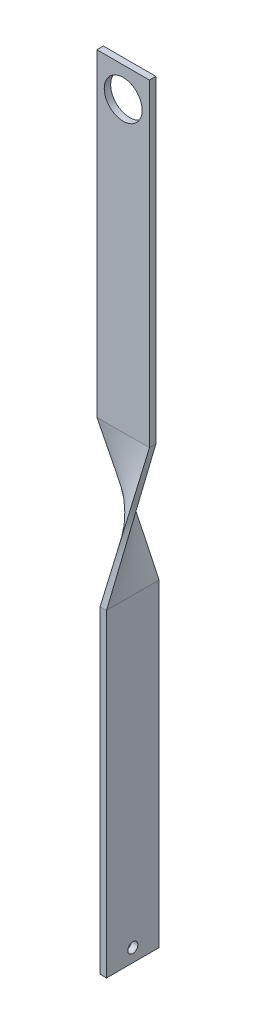
ISO-10303-21;
HEADER;
FILE_DESCRIPTION(('STEP AP214'),'2;1');
FILE_NAME('part.step','',(''),(''),'','','');
FILE_SCHEMA(('AUTOMOTIVE_DESIGN { 1 0 10303 214 1 1 1 1 }'));
ENDSEC;
DATA;
#1=APPLICATION_CONTEXT('core data for automotive mechanical design processes');
#2=APPLICATION_PROTOCOL_DEFINITION('international standard','automotive_design',2000,#1);
#3=PRODUCT_CONTEXT('',#1,'mechanical');
#4=PRODUCT('Part','Part','',(#3));
#5=PRODUCT_RELATED_PRODUCT_CATEGORY('part','',(#4));
#6=PRODUCT_DEFINITION_FORMATION('','',#4);
#7=PRODUCT_DEFINITION_CONTEXT('part definition',#1,'design');
#8=PRODUCT_DEFINITION('design','',#6,#7);
#9=PRODUCT_DEFINITION_SHAPE('','',#8);
#10=(LENGTH_UNIT() NAMED_UNIT(*) SI_UNIT(.MILLI.,.METRE.));
#11=(NAMED_UNIT(*) PLANE_ANGLE_UNIT() SI_UNIT($,.RADIAN.));
#12=(NAMED_UNIT(*) SI_UNIT($,.STERADIAN.) SOLID_ANGLE_UNIT());
#13=UNCERTAINTY_MEASURE_WITH_UNIT(LENGTH_MEASURE(1.E-05),#10,'distance_accuracy_value','');
#14=(GEOMETRIC_REPRESENTATION_CONTEXT(3) GLOBAL_UNCERTAINTY_ASSIGNED_CONTEXT((#13)) GLOBAL_UNIT_ASSIGNED_CONTEXT((#10,
#11,#12)) REPRESENTATION_CONTEXT('',''));
#15=CARTESIAN_POINT('',(0.,0.,0.));
#16=DIRECTION('',(0.,0.,1.));
#17=DIRECTION('',(1.,0.,0.));
#18=AXIS2_PLACEMENT_3D('',#15,#16,#17);
#19=CARTESIAN_POINT('',(0.,0.,1.6129));
#20=DIRECTION('',(1.,0.,0.));
#21=DIRECTION('',(0.,0.,-1.));
#22=AXIS2_PLACEMENT_3D('',#19,#20,#21);
#23=PLANE('',#22);
#24=DIRECTION('',(0.,-1.,0.));
#25=VECTOR('',#24,1.);
#26=CARTESIAN_POINT('',(0.,0.,0.));
#27=LINE('',#26,#25);
#28=CARTESIAN_POINT('',(0.,0.,0.));
#29=VERTEX_POINT('',#28);
#30=CARTESIAN_POINT('',(0.,-79.9999999999999,0.));
#31=VERTEX_POINT('',#30);
#32=EDGE_CURVE('E218',#29,#31,#27,.T.);
#33=ORIENTED_EDGE('',*,*,#32,.T.);
#34=DIRECTION('',(0.,0.,-1.));
#35=VECTOR('',#34,1.);
#36=CARTESIAN_POINT('',(0.,-80.,1.6129));
#37=LINE('',#36,#35);
#38=CARTESIAN_POINT('',(0.,-79.9999999999999,1.61290000000001));
#39=VERTEX_POINT('',#38);
#40=EDGE_CURVE('E12',#39,#31,#37,.T.);
#41=ORIENTED_EDGE('',*,*,#40,.F.);
#42=DIRECTION('',(0.,-1.,0.));
#43=VECTOR('',#42,1.);
#44=CARTESIAN_POINT('',(0.,0.,1.6129));
#45=LINE('',#44,#43);
#46=CARTESIAN_POINT('',(0.,0.,1.6129));
#47=VERTEX_POINT('',#46);
#48=EDGE_CURVE('E92',#47,#39,#45,.T.);
#49=ORIENTED_EDGE('',*,*,#48,.F.);
#50=DIRECTION('',(0.,0.,-1.));
#51=VECTOR('',#50,1.);
#52=CARTESIAN_POINT('',(0.,0.,1.6129));
#53=LINE('',#52,#51);
#54=EDGE_CURVE('E284',#47,#29,#53,.T.);
#55=ORIENTED_EDGE('',*,*,#54,.T.);
#56=EDGE_LOOP('',(#33,#41,#49,#55));
#57=FACE_BOUND('',#56,.T.);
#58=ADVANCED_FACE('F47',(#57),#23,.F.);
#59=CARTESIAN_POINT('',(13.208,0.,1.6129));
#60=DIRECTION('',(-1.,0.,0.));
#61=DIRECTION('',(0.,-1.,0.));
#62=AXIS2_PLACEMENT_3D('',#59,#60,#61);
#63=PLANE('',#62);
#64=DIRECTION('',(0.,1.,0.));
#65=VECTOR('',#64,1.);
#66=CARTESIAN_POINT('',(13.208,0.,0.));
#67=LINE('',#66,#65);
#68=CARTESIAN_POINT('',(13.208,-80.,0.));
#69=VERTEX_POINT('',#68);
#70=CARTESIAN_POINT('',(13.208,0.,0.));
#71=VERTEX_POINT('',#70);
#72=EDGE_CURVE('E288',#69,#71,#67,.T.);
#73=ORIENTED_EDGE('',*,*,#72,.T.);
#74=DIRECTION('',(0.,0.,-1.));
#75=VECTOR('',#74,1.);
#76=CARTESIAN_POINT('',(13.208,0.,1.6129));
#77=LINE('',#76,#75);
#78=CARTESIAN_POINT('',(13.208,0.,1.6129));
#79=VERTEX_POINT('',#78);
#80=EDGE_CURVE('E106',#79,#71,#77,.T.);
#81=ORIENTED_EDGE('',*,*,#80,.F.);
#82=DIRECTION('',(0.,1.,0.));
#83=VECTOR('',#82,1.);
#84=CARTESIAN_POINT('',(13.208,0.,1.6129));
#85=LINE('',#84,#83);
#86=CARTESIAN_POINT('',(13.208,-79.9999999999996,1.61289999999997));
#87=VERTEX_POINT('',#86);
#88=EDGE_CURVE('E89',#87,#79,#85,.T.);
#89=ORIENTED_EDGE('',*,*,#88,.F.);
#90=DIRECTION('',(0.,0.,1.));
#91=VECTOR('',#90,1.);
#92=CARTESIAN_POINT('',(13.208,-80.,1.6129));
#93=LINE('',#92,#91);
#94=EDGE_CURVE('E57',#87,#69,#93,.F.);
#95=ORIENTED_EDGE('',*,*,#94,.T.);
#96=EDGE_LOOP('',(#73,#81,#89,#95));
#97=FACE_BOUND('',#96,.T.);
#98=ADVANCED_FACE('F103',(#97),#63,.F.);
#99=CARTESIAN_POINT('',(0.,0.,1.6129));
#100=DIRECTION('',(0.,-1.,0.));
#101=DIRECTION('',(0.,0.,-1.));
#102=AXIS2_PLACEMENT_3D('',#99,#100,#101);
#103=PLANE('',#102);
#104=DIRECTION('',(-1.,0.,0.));
#105=VECTOR('',#104,1.);
#106=CARTESIAN_POINT('',(0.,0.,0.));
#107=LINE('',#106,#105);
#108=EDGE_CURVE('E285',#71,#29,#107,.T.);
#109=ORIENTED_EDGE('',*,*,#108,.T.);
#110=ORIENTED_EDGE('',*,*,#54,.F.);
#111=DIRECTION('',(-1.,0.,0.));
#112=VECTOR('',#111,1.);
#113=CARTESIAN_POINT('',(0.,0.,1.6129));
#114=LINE('',#113,#112);
#115=EDGE_CURVE('E66',#79,#47,#114,.T.);
#116=ORIENTED_EDGE('',*,*,#115,.F.);
#117=ORIENTED_EDGE('',*,*,#80,.T.);
#118=EDGE_LOOP('',(#109,#110,#116,#117));
#119=FACE_BOUND('',#118,.T.);
#120=ADVANCED_FACE('F373',(#119),#103,.F.);
#121=CARTESIAN_POINT('',(0.,0.,1.6129));
#122=DIRECTION('',(0.,0.,1.));
#123=DIRECTION('',(1.,0.,0.));
#124=AXIS2_PLACEMENT_3D('',#121,#122,#123);
#125=PLANE('',#124);
#126=CARTESIAN_POINT('',(6.604,-7.5,1.6129));
#127=DIRECTION('',(0.,0.,1.));
#128=DIRECTION('',(1.,0.,0.));
#129=AXIS2_PLACEMENT_3D('',#126,#127,#128);
#130=CIRCLE('',#129,4.7625);
#131=CARTESIAN_POINT('',(11.3665,-7.5,1.6129));
#132=VERTEX_POINT('',#131);
#133=EDGE_CURVE('E450',#132,#132,#130,.T.);
#134=ORIENTED_EDGE('',*,*,#133,.F.);
#135=EDGE_LOOP('',(#134));
#136=FACE_BOUND('',#135,.T.);
#137=ORIENTED_EDGE('',*,*,#48,.T.);
#138=DIRECTION('',(1.,0.,0.));
#139=VECTOR('',#138,1.);
#140=CARTESIAN_POINT('',(0.,-80.,1.6129));
#141=LINE('',#140,#139);
#142=EDGE_CURVE('E86',#39,#87,#141,.T.);
#143=ORIENTED_EDGE('',*,*,#142,.T.);
#144=ORIENTED_EDGE('',*,*,#88,.T.);
#145=ORIENTED_EDGE('',*,*,#115,.T.);
#146=EDGE_LOOP('',(#137,#143,#144,#145));
#147=FACE_BOUND('',#146,.T.);
#148=ADVANCED_FACE('F88',(#136,#147),#125,.T.);
#149=CARTESIAN_POINT('',(0.,0.,0.));
#150=DIRECTION('',(0.,0.,1.));
#151=DIRECTION('',(1.,0.,0.));
#152=AXIS2_PLACEMENT_3D('',#149,#150,#151);
#153=PLANE('',#152);
#154=CARTESIAN_POINT('',(6.604,-7.5,0.));
#155=DIRECTION('',(0.,0.,-1.));
#156=DIRECTION('',(-1.,0.,0.));
#157=AXIS2_PLACEMENT_3D('',#154,#155,#156);
#158=CIRCLE('',#157,4.7625);
#159=CARTESIAN_POINT('',(1.8415,-7.5,0.));
#160=VERTEX_POINT('',#159);
#161=EDGE_CURVE('E453',#160,#160,#158,.T.);
#162=ORIENTED_EDGE('',*,*,#161,.F.);
#163=EDGE_LOOP('',(#162));
#164=FACE_BOUND('',#163,.T.);
#165=ORIENTED_EDGE('',*,*,#32,.F.);
#166=ORIENTED_EDGE('',*,*,#108,.F.);
#167=ORIENTED_EDGE('',*,*,#72,.F.);
#168=DIRECTION('',(1.,0.,0.));
#169=VECTOR('',#168,1.);
#170=CARTESIAN_POINT('',(0.,-80.,0.));
#171=LINE('',#170,#169);
#172=EDGE_CURVE('E296',#31,#69,#171,.T.);
#173=ORIENTED_EDGE('',*,*,#172,.F.);
#174=EDGE_LOOP('',(#165,#166,#167,#173));
#175=FACE_BOUND('',#174,.T.);
#176=ADVANCED_FACE('F378',(#164,#175),#153,.F.);
#177=CARTESIAN_POINT('',(13.208,-80.,1.6129));
#178=CARTESIAN_POINT('',(6.604,-115.,7.41045));
#179=CARTESIAN_POINT('',(11.0066666666667,-80.,1.6129));
#180=CARTESIAN_POINT('',(6.604,-115.,5.20911666666666));
#181=CARTESIAN_POINT('',(8.80533333333331,-80.,1.6129));
#182=CARTESIAN_POINT('',(6.604,-115.,3.00778333333333));
#183=CARTESIAN_POINT('',(4.40266666666664,-80.,1.6129));
#184=CARTESIAN_POINT('',(6.604,-115.,-1.39488333333333));
#185=CARTESIAN_POINT('',(2.20133333333332,-80.,1.6129));
#186=CARTESIAN_POINT('',(6.604,-115.,-3.59621666666667));
#187=CARTESIAN_POINT('',(0.,-80.,1.6129));
#188=CARTESIAN_POINT('',(6.604,-115.,-5.79755));
#189=B_SPLINE_SURFACE_WITH_KNOTS('',3,1,((#177,#178),(#179,#180),(#181,#182),(#183,#184),(#185,
#186),(#187,#188)),.UNSPECIFIED.,.F.,.F.,.F.,(4,2,4),(2,2),(0.,0.5,1.),(0.,1.),.UNSPECIFIED.);
#190=DIRECTION('',(0.181526722270291,-0.962058643164778,-0.203693927778298));
#191=VECTOR('',#190,1.);
#192=CARTESIAN_POINT('',(3.302,-97.5,-2.092325));
#193=LINE('',#192,#191);
#194=CARTESIAN_POINT('',(6.604,-115.,-5.79755));
#195=VERTEX_POINT('',#194);
#196=EDGE_CURVE('E127',#39,#195,#193,.T.);
#197=DIRECTION('',(0.,0.,1.));
#198=VECTOR('',#197,1.);
#199=CARTESIAN_POINT('',(6.604,-115.,7.41045));
#200=LINE('',#199,#198);
#201=CARTESIAN_POINT('',(6.604,-115.,7.41045));
#202=VERTEX_POINT('',#201);
#203=EDGE_CURVE('E123',#195,#202,#200,.T.);
#204=DIRECTION('',(0.183005503323815,0.969895914042023,-0.160657715898695));
#205=VECTOR('',#204,1.);
#206=CARTESIAN_POINT('',(9.90600000000001,-97.5,4.511675));
#207=LINE('',#206,#205);
#208=EDGE_CURVE('E115',#202,#87,#207,.T.);
#209=ORIENTED_EDGE('',*,*,#142,.F.);
#210=ORIENTED_EDGE('',*,*,#196,.T.);
#211=ORIENTED_EDGE('',*,*,#203,.T.);
#212=ORIENTED_EDGE('',*,*,#208,.T.);
#213=EDGE_LOOP('',(#209,#210,#211,#212));
#214=FACE_BOUND('',#213,.T.);
#215=ADVANCED_FACE('F121',(#214),#189,.T.);
#216=CARTESIAN_POINT('',(0.,-80.,1.6129));
#217=CARTESIAN_POINT('',(6.604,-115.,-5.79755));
#218=CARTESIAN_POINT('',(0.,-80.,1.34408333333333));
#219=CARTESIAN_POINT('',(6.87281666666667,-115.,-5.79755));
#220=CARTESIAN_POINT('',(0.,-80.,1.07526666666667));
#221=CARTESIAN_POINT('',(7.14163333333333,-115.,-5.79755));
#222=CARTESIAN_POINT('',(0.,-80.,0.537633333333334));
#223=CARTESIAN_POINT('',(7.67926666666667,-115.,-5.79755));
#224=CARTESIAN_POINT('',(0.,-80.,0.268816666666667));
#225=CARTESIAN_POINT('',(7.94808333333333,-115.,-5.79755));
#226=CARTESIAN_POINT('',(0.,-80.,0.));
#227=CARTESIAN_POINT('',(8.2169,-115.,-5.79755));
#228=B_SPLINE_SURFACE_WITH_KNOTS('',3,1,((#216,#217),(#218,#219),(#220,#221),(#222,#223),(#224,
#225),(#226,#227)),.UNSPECIFIED.,.F.,.F.,.F.,(4,2,4),(2,2),(0.,0.5,1.),(0.,1.),.UNSPECIFIED.);
#229=DIRECTION('',(0.2256394904228,-0.961114552300502,-0.159203133505422));
#230=VECTOR('',#229,1.);
#231=CARTESIAN_POINT('',(4.10845,-97.5,-2.898775));
#232=LINE('',#231,#230);
#233=CARTESIAN_POINT('',(8.2169,-115.,-5.79755));
#234=VERTEX_POINT('',#233);
#235=EDGE_CURVE('E132',#31,#234,#232,.T.);
#236=DIRECTION('',(-1.,0.,0.));
#237=VECTOR('',#236,1.);
#238=CARTESIAN_POINT('',(8.2169,-115.,-5.79755));
#239=LINE('',#238,#237);
#240=EDGE_CURVE('E149',#234,#195,#239,.T.);
#241=ORIENTED_EDGE('',*,*,#40,.T.);
#242=ORIENTED_EDGE('',*,*,#235,.T.);
#243=ORIENTED_EDGE('',*,*,#240,.T.);
#244=ORIENTED_EDGE('',*,*,#196,.F.);
#245=EDGE_LOOP('',(#241,#242,#243,#244));
#246=FACE_BOUND('',#245,.T.);
#247=ADVANCED_FACE('F156',(#246),#228,.T.);
#248=CARTESIAN_POINT('',(13.208,-80.,0.));
#249=CARTESIAN_POINT('',(8.2169,-115.,7.41045));
#250=CARTESIAN_POINT('',(13.208,-80.,0.268816666666667));
#251=CARTESIAN_POINT('',(7.94808333333333,-115.,7.41045));
#252=CARTESIAN_POINT('',(13.208,-80.,0.537633333333334));
#253=CARTESIAN_POINT('',(7.67926666666667,-115.,7.41045));
#254=CARTESIAN_POINT('',(13.208,-80.,1.07526666666667));
#255=CARTESIAN_POINT('',(7.14163333333333,-115.,7.41045));
#256=CARTESIAN_POINT('',(13.208,-80.,1.34408333333333));
#257=CARTESIAN_POINT('',(6.87281666666667,-115.,7.41045));
#258=CARTESIAN_POINT('',(13.208,-80.,1.6129));
#259=CARTESIAN_POINT('',(6.604,-115.,7.41045));
#260=B_SPLINE_SURFACE_WITH_KNOTS('',3,1,((#248,#249),(#250,#251),(#252,#253),(#254,#255),(#256,
#257),(#258,#259)),.UNSPECIFIED.,.F.,.F.,.F.,(4,2,4),(2,2),(0.,0.5,1.),(0.,1.),.UNSPECIFIED.);
#261=DIRECTION('',(-1.,0.,0.));
#262=VECTOR('',#261,1.);
#263=CARTESIAN_POINT('',(8.2169,-115.,7.41045));
#264=LINE('',#263,#262);
#265=CARTESIAN_POINT('',(8.2169,-115.,7.41045));
#266=VERTEX_POINT('',#265);
#267=EDGE_CURVE('E268',#266,#202,#264,.T.);
#268=DIRECTION('',(-0.138171984630874,-0.968928585297948,0.205148480997748));
#269=VECTOR('',#268,1.);
#270=CARTESIAN_POINT('',(10.71245,-97.5,3.705225));
#271=LINE('',#270,#269);
#272=EDGE_CURVE('E118',#69,#266,#271,.T.);
#273=ORIENTED_EDGE('',*,*,#94,.F.);
#274=ORIENTED_EDGE('',*,*,#208,.F.);
#275=ORIENTED_EDGE('',*,*,#267,.F.);
#276=ORIENTED_EDGE('',*,*,#272,.F.);
#277=EDGE_LOOP('',(#273,#274,#275,#276));
#278=FACE_BOUND('',#277,.T.);
#279=ADVANCED_FACE('F112',(#278),#260,.T.);
#280=CARTESIAN_POINT('',(0.,-80.,0.));
#281=CARTESIAN_POINT('',(8.2169,-115.,-5.79755));
#282=CARTESIAN_POINT('',(2.20133333333333,-80.,0.));
#283=CARTESIAN_POINT('',(8.2169,-115.,-3.59621666666666));
#284=CARTESIAN_POINT('',(4.40266666666667,-80.,0.));
#285=CARTESIAN_POINT('',(8.2169,-115.,-1.39488333333333));
#286=CARTESIAN_POINT('',(8.80533333333334,-80.,0.));
#287=CARTESIAN_POINT('',(8.2169,-115.,3.00778333333334));
#288=CARTESIAN_POINT('',(11.0066666666667,-80.,0.));
#289=CARTESIAN_POINT('',(8.2169,-115.,5.20911666666667));
#290=CARTESIAN_POINT('',(13.208,-80.,0.));
#291=CARTESIAN_POINT('',(8.2169,-115.,7.41045));
#292=B_SPLINE_SURFACE_WITH_KNOTS('',3,1,((#280,#281),(#282,#283),(#284,#285),(#286,#287),(#288,
#289),(#290,#291)),.UNSPECIFIED.,.F.,.F.,.F.,(4,2,4),(2,2),(0.,0.5,1.),(0.,1.),.UNSPECIFIED.);
#293=DIRECTION('',(0.,0.,1.));
#294=VECTOR('',#293,1.);
#295=CARTESIAN_POINT('',(8.2169,-115.,7.41045));
#296=LINE('',#295,#294);
#297=EDGE_CURVE('E219',#234,#266,#296,.T.);
#298=ORIENTED_EDGE('',*,*,#172,.T.);
#299=ORIENTED_EDGE('',*,*,#272,.T.);
#300=ORIENTED_EDGE('',*,*,#297,.F.);
#301=ORIENTED_EDGE('',*,*,#235,.F.);
#302=EDGE_LOOP('',(#298,#299,#300,#301));
#303=FACE_BOUND('',#302,.T.);
#304=ADVANCED_FACE('F182',(#303),#292,.T.);
#305=CARTESIAN_POINT('',(8.2169,-195.,-5.79755));
#306=DIRECTION('',(0.,0.,1.));
#307=DIRECTION('',(1.,0.,0.));
#308=AXIS2_PLACEMENT_3D('',#305,#306,#307);
#309=PLANE('',#308);
#310=DIRECTION('',(0.,1.,0.));
#311=VECTOR('',#310,1.);
#312=CARTESIAN_POINT('',(6.604,-195.,-5.79755));
#313=LINE('',#312,#311);
#314=CARTESIAN_POINT('',(6.604,-195.,-5.79755));
#315=VERTEX_POINT('',#314);
#316=EDGE_CURVE('E223',#315,#195,#313,.T.);
#317=ORIENTED_EDGE('',*,*,#316,.T.);
#318=ORIENTED_EDGE('',*,*,#240,.F.);
#319=DIRECTION('',(0.,1.,0.));
#320=VECTOR('',#319,1.);
#321=CARTESIAN_POINT('',(8.2169,-195.,-5.79755));
#322=LINE('',#321,#320);
#323=CARTESIAN_POINT('',(8.2169,-195.,-5.79755));
#324=VERTEX_POINT('',#323);
#325=EDGE_CURVE('E312',#324,#234,#322,.T.);
#326=ORIENTED_EDGE('',*,*,#325,.F.);
#327=DIRECTION('',(-1.,0.,0.));
#328=VECTOR('',#327,1.);
#329=CARTESIAN_POINT('',(8.2169,-195.,-5.79755));
#330=LINE('',#329,#328);
#331=EDGE_CURVE('E135',#324,#315,#330,.T.);
#332=ORIENTED_EDGE('',*,*,#331,.T.);
#333=EDGE_LOOP('',(#317,#318,#326,#332));
#334=FACE_BOUND('',#333,.T.);
#335=ADVANCED_FACE('F259',(#334),#309,.F.);
#336=CARTESIAN_POINT('',(8.2169,-195.,7.41045));
#337=DIRECTION('',(0.,0.,-1.));
#338=DIRECTION('',(-1.,0.,0.));
#339=AXIS2_PLACEMENT_3D('',#336,#337,#338);
#340=PLANE('',#339);
#341=DIRECTION('',(0.,-1.,0.));
#342=VECTOR('',#341,1.);
#343=CARTESIAN_POINT('',(6.604,-195.,7.41045));
#344=LINE('',#343,#342);
#345=CARTESIAN_POINT('',(6.604,-195.,7.41045));
#346=VERTEX_POINT('',#345);
#347=EDGE_CURVE('E227',#202,#346,#344,.T.);
#348=ORIENTED_EDGE('',*,*,#347,.T.);
#349=DIRECTION('',(-1.,0.,0.));
#350=VECTOR('',#349,1.);
#351=CARTESIAN_POINT('',(8.2169,-195.,7.41045));
#352=LINE('',#351,#350);
#353=CARTESIAN_POINT('',(8.2169,-195.,7.41045));
#354=VERTEX_POINT('',#353);
#355=EDGE_CURVE('E128',#354,#346,#352,.T.);
#356=ORIENTED_EDGE('',*,*,#355,.F.);
#357=DIRECTION('',(0.,-1.,0.));
#358=VECTOR('',#357,1.);
#359=CARTESIAN_POINT('',(8.2169,-195.,7.41045));
#360=LINE('',#359,#358);
#361=EDGE_CURVE('E277',#266,#354,#360,.T.);
#362=ORIENTED_EDGE('',*,*,#361,.F.);
#363=ORIENTED_EDGE('',*,*,#267,.T.);
#364=EDGE_LOOP('',(#348,#356,#362,#363));
#365=FACE_BOUND('',#364,.T.);
#366=ADVANCED_FACE('F255',(#365),#340,.F.);
#367=CARTESIAN_POINT('',(8.2169,-195.,7.41045));
#368=DIRECTION('',(0.,1.,0.));
#369=DIRECTION('',(0.,0.,1.));
#370=AXIS2_PLACEMENT_3D('',#367,#368,#369);
#371=PLANE('',#370);
#372=DIRECTION('',(0.,0.,-1.));
#373=VECTOR('',#372,1.);
#374=CARTESIAN_POINT('',(6.604,-195.,7.41045));
#375=LINE('',#374,#373);
#376=EDGE_CURVE('E306',#346,#315,#375,.T.);
#377=ORIENTED_EDGE('',*,*,#376,.T.);
#378=ORIENTED_EDGE('',*,*,#331,.F.);
#379=DIRECTION('',(0.,0.,-1.));
#380=VECTOR('',#379,1.);
#381=CARTESIAN_POINT('',(8.2169,-195.,7.41045));
#382=LINE('',#381,#380);
#383=EDGE_CURVE('E323',#354,#324,#382,.T.);
#384=ORIENTED_EDGE('',*,*,#383,.F.);
#385=ORIENTED_EDGE('',*,*,#355,.T.);
#386=EDGE_LOOP('',(#377,#378,#384,#385));
#387=FACE_BOUND('',#386,.T.);
#388=ADVANCED_FACE('F252',(#387),#371,.F.);
#389=CARTESIAN_POINT('',(8.2169,0.,0.));
#390=DIRECTION('',(-1.,0.,0.));
#391=DIRECTION('',(0.,0.,1.));
#392=AXIS2_PLACEMENT_3D('',#389,#390,#391);
#393=PLANE('',#392);
#394=CARTESIAN_POINT('',(8.2169,-191.698,0.806449999999999));
#395=DIRECTION('',(1.,0.,0.));
#396=DIRECTION('',(0.,0.,-1.));
#397=AXIS2_PLACEMENT_3D('',#394,#395,#396);
#398=CIRCLE('',#397,1.27);
#399=CARTESIAN_POINT('',(8.2169,-191.698,-0.463550000000003));
#400=VERTEX_POINT('',#399);
#401=EDGE_CURVE('E457',#400,#400,#398,.T.);
#402=ORIENTED_EDGE('',*,*,#401,.F.);
#403=EDGE_LOOP('',(#402));
#404=FACE_BOUND('',#403,.T.);
#405=ORIENTED_EDGE('',*,*,#325,.T.);
#406=ORIENTED_EDGE('',*,*,#297,.T.);
#407=ORIENTED_EDGE('',*,*,#361,.T.);
#408=ORIENTED_EDGE('',*,*,#383,.T.);
#409=EDGE_LOOP('',(#405,#406,#407,#408));
#410=FACE_BOUND('',#409,.T.);
#411=ADVANCED_FACE('F248',(#404,#410),#393,.F.);
#412=CARTESIAN_POINT('',(6.604,0.,0.));
#413=DIRECTION('',(-1.,0.,0.));
#414=DIRECTION('',(0.,0.,1.));
#415=AXIS2_PLACEMENT_3D('',#412,#413,#414);
#416=PLANE('',#415);
#417=CARTESIAN_POINT('',(6.604,-191.698,0.806449999999999));
#418=DIRECTION('',(-1.,0.,0.));
#419=DIRECTION('',(0.,0.,1.));
#420=AXIS2_PLACEMENT_3D('',#417,#418,#419);
#421=CIRCLE('',#420,1.27);
#422=CARTESIAN_POINT('',(6.604,-191.698,2.07645));
#423=VERTEX_POINT('',#422);
#424=EDGE_CURVE('E50',#423,#423,#421,.T.);
#425=ORIENTED_EDGE('',*,*,#424,.F.);
#426=EDGE_LOOP('',(#425));
#427=FACE_BOUND('',#426,.T.);
#428=ORIENTED_EDGE('',*,*,#316,.F.);
#429=ORIENTED_EDGE('',*,*,#376,.F.);
#430=ORIENTED_EDGE('',*,*,#347,.F.);
#431=ORIENTED_EDGE('',*,*,#203,.F.);
#432=EDGE_LOOP('',(#428,#429,#430,#431));
#433=FACE_BOUND('',#432,.T.);
#434=ADVANCED_FACE('F237',(#427,#433),#416,.T.);
#435=CARTESIAN_POINT('',(-2.50000000111272E-05,-191.698,0.806449999999999));
#436=DIRECTION('',(1.,0.,0.));
#437=DIRECTION('',(0.,0.,-1.));
#438=AXIS2_PLACEMENT_3D('',#435,#436,#437);
#439=CYLINDRICAL_SURFACE('',#438,1.27);
#440=ORIENTED_EDGE('',*,*,#424,.T.);
#441=EDGE_LOOP('',(#440));
#442=FACE_BOUND('',#441,.T.);
#443=ORIENTED_EDGE('',*,*,#401,.T.);
#444=EDGE_LOOP('',(#443));
#445=FACE_BOUND('',#444,.T.);
#446=ADVANCED_FACE('F247',(#442,#445),#439,.F.);
#447=CARTESIAN_POINT('',(6.604,-7.5,7.41055));
#448=DIRECTION('',(0.,0.,-1.));
#449=DIRECTION('',(-1.,0.,0.));
#450=AXIS2_PLACEMENT_3D('',#447,#448,#449);
#451=CYLINDRICAL_SURFACE('',#450,4.7625);
#452=ORIENTED_EDGE('',*,*,#133,.T.);
#453=EDGE_LOOP('',(#452));
#454=FACE_BOUND('',#453,.T.);
#455=ORIENTED_EDGE('',*,*,#161,.T.);
#456=EDGE_LOOP('',(#455));
#457=FACE_BOUND('',#456,.T.);
#458=ADVANCED_FACE('F413',(#454,#457),#451,.F.);
#459=CLOSED_SHELL('',(#58,#98,#120,#148,#176,#215,#247,#279,#304,#335,#366,#388,#411,#434,#446,#458));
#460=MANIFOLD_SOLID_BREP('B2',#459);
#461=ADVANCED_BREP_SHAPE_REPRESENTATION('',(#18,#460),#14);
#462=SHAPE_DEFINITION_REPRESENTATION(#9,#461);
ENDSEC;
END-ISO-10303-21;
